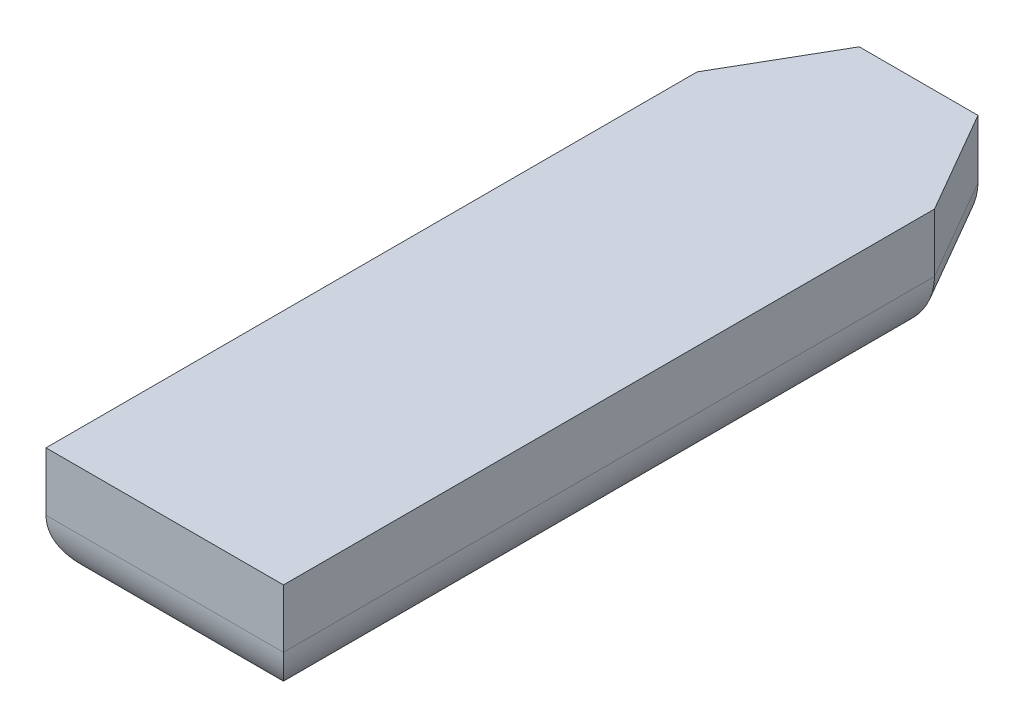
ISO-10303-21;
HEADER;
FILE_DESCRIPTION(('STEP AP214'),'2;1');
FILE_NAME('part.step','',(''),(''),'','','');
FILE_SCHEMA(('AUTOMOTIVE_DESIGN { 1 0 10303 214 1 1 1 1 }'));
ENDSEC;
DATA;
#1=APPLICATION_CONTEXT('core data for automotive mechanical design processes');
#2=APPLICATION_PROTOCOL_DEFINITION('international standard','automotive_design',2000,#1);
#3=PRODUCT_CONTEXT('',#1,'mechanical');
#4=PRODUCT('Part','Part','',(#3));
#5=PRODUCT_RELATED_PRODUCT_CATEGORY('part','',(#4));
#6=PRODUCT_DEFINITION_FORMATION('','',#4);
#7=PRODUCT_DEFINITION_CONTEXT('part definition',#1,'design');
#8=PRODUCT_DEFINITION('design','',#6,#7);
#9=PRODUCT_DEFINITION_SHAPE('','',#8);
#10=(LENGTH_UNIT() NAMED_UNIT(*) SI_UNIT(.MILLI.,.METRE.));
#11=(NAMED_UNIT(*) PLANE_ANGLE_UNIT() SI_UNIT($,.RADIAN.));
#12=(NAMED_UNIT(*) SI_UNIT($,.STERADIAN.) SOLID_ANGLE_UNIT());
#13=UNCERTAINTY_MEASURE_WITH_UNIT(LENGTH_MEASURE(1.E-05),#10,'distance_accuracy_value','');
#14=(GEOMETRIC_REPRESENTATION_CONTEXT(3) GLOBAL_UNCERTAINTY_ASSIGNED_CONTEXT((#13)) GLOBAL_UNIT_ASSIGNED_CONTEXT((#10,
#11,#12)) REPRESENTATION_CONTEXT('',''));
#15=CARTESIAN_POINT('',(0.,0.,0.));
#16=DIRECTION('',(0.,0.,1.));
#17=DIRECTION('',(1.,0.,0.));
#18=AXIS2_PLACEMENT_3D('',#15,#16,#17);
#19=CARTESIAN_POINT('',(-10.,10.,27.4198729810778));
#20=DIRECTION('',(0.,0.,-1.));
#21=DIRECTION('',(-1.,0.,0.));
#22=AXIS2_PLACEMENT_3D('',#19,#20,#21);
#23=PLANE('',#22);
#24=DIRECTION('',(0.,-1.,0.));
#25=VECTOR('',#24,1.);
#26=CARTESIAN_POINT('',(-10.,10.,27.4198729810778));
#27=LINE('',#26,#25);
#28=CARTESIAN_POINT('',(-10.,10.,27.4198729810778));
#29=VERTEX_POINT('',#28);
#30=CARTESIAN_POINT('',(-10.,5.08,27.4198729810778));
#31=VERTEX_POINT('',#30);
#32=EDGE_CURVE('E201',#29,#31,#27,.T.);
#33=ORIENTED_EDGE('',*,*,#32,.T.);
#34=DIRECTION('',(1.,0.,0.));
#35=VECTOR('',#34,1.);
#36=CARTESIAN_POINT('',(-10.,5.08,27.4198729810778));
#37=LINE('',#36,#35);
#38=CARTESIAN_POINT('',(10.,5.08,27.4198729810778));
#39=VERTEX_POINT('',#38);
#40=EDGE_CURVE('E11',#31,#39,#37,.T.);
#41=ORIENTED_EDGE('',*,*,#40,.T.);
#42=DIRECTION('',(0.,-1.,0.));
#43=VECTOR('',#42,1.);
#44=CARTESIAN_POINT('',(10.,10.,27.4198729810778));
#45=LINE('',#44,#43);
#46=CARTESIAN_POINT('',(10.,10.,27.4198729810778));
#47=VERTEX_POINT('',#46);
#48=EDGE_CURVE('E112',#47,#39,#45,.T.);
#49=ORIENTED_EDGE('',*,*,#48,.F.);
#50=DIRECTION('',(1.,0.,0.));
#51=VECTOR('',#50,1.);
#52=CARTESIAN_POINT('',(-10.,10.,27.4198729810778));
#53=LINE('',#52,#51);
#54=EDGE_CURVE('E119',#29,#47,#53,.T.);
#55=ORIENTED_EDGE('',*,*,#54,.F.);
#56=EDGE_LOOP('',(#33,#41,#49,#55));
#57=FACE_BOUND('',#56,.T.);
#58=ADVANCED_FACE('F33',(#57),#23,.F.);
#59=CARTESIAN_POINT('',(10.,10.,27.4198729810778));
#60=DIRECTION('',(-1.,0.,0.));
#61=DIRECTION('',(0.,0.,1.));
#62=AXIS2_PLACEMENT_3D('',#59,#60,#61);
#63=PLANE('',#62);
#64=ORIENTED_EDGE('',*,*,#48,.T.);
#65=DIRECTION('',(0.,0.,-1.));
#66=VECTOR('',#65,1.);
#67=CARTESIAN_POINT('',(10.,5.08,27.4198729810778));
#68=LINE('',#67,#66);
#69=CARTESIAN_POINT('',(10.,5.08,-27.4198729810779));
#70=VERTEX_POINT('',#69);
#71=EDGE_CURVE('E128',#39,#70,#68,.T.);
#72=ORIENTED_EDGE('',*,*,#71,.T.);
#73=DIRECTION('',(0.,-1.,0.));
#74=VECTOR('',#73,1.);
#75=CARTESIAN_POINT('',(10.,10.,-27.4198729810779));
#76=LINE('',#75,#74);
#77=CARTESIAN_POINT('',(10.,10.,-27.4198729810779));
#78=VERTEX_POINT('',#77);
#79=EDGE_CURVE('E115',#78,#70,#76,.T.);
#80=ORIENTED_EDGE('',*,*,#79,.F.);
#81=DIRECTION('',(0.,0.,-1.));
#82=VECTOR('',#81,1.);
#83=CARTESIAN_POINT('',(10.,10.,27.4198729810778));
#84=LINE('',#83,#82);
#85=EDGE_CURVE('E107',#47,#78,#84,.T.);
#86=ORIENTED_EDGE('',*,*,#85,.F.);
#87=EDGE_LOOP('',(#64,#72,#80,#86));
#88=FACE_BOUND('',#87,.T.);
#89=ADVANCED_FACE('F109',(#88),#63,.F.);
#90=CARTESIAN_POINT('',(10.,10.,-27.4198729810779));
#91=DIRECTION('',(-0.866025403784436,0.,0.500000000000004));
#92=DIRECTION('',(0.500000000000004,0.,0.866025403784436));
#93=AXIS2_PLACEMENT_3D('',#90,#91,#92);
#94=PLANE('',#93);
#95=ORIENTED_EDGE('',*,*,#79,.T.);
#96=DIRECTION('',(-0.500000000000004,0.,-0.866025403784436));
#97=VECTOR('',#96,1.);
#98=CARTESIAN_POINT('',(10.,5.08,-27.4198729810779));
#99=LINE('',#98,#97);
#100=CARTESIAN_POINT('',(5.,5.08,-36.0801270189222));
#101=VERTEX_POINT('',#100);
#102=EDGE_CURVE('E148',#70,#101,#99,.T.);
#103=ORIENTED_EDGE('',*,*,#102,.T.);
#104=DIRECTION('',(0.,-1.,0.));
#105=VECTOR('',#104,1.);
#106=CARTESIAN_POINT('',(5.,10.,-36.0801270189222));
#107=LINE('',#106,#105);
#108=CARTESIAN_POINT('',(5.,10.,-36.0801270189222));
#109=VERTEX_POINT('',#108);
#110=EDGE_CURVE('E132',#109,#101,#107,.T.);
#111=ORIENTED_EDGE('',*,*,#110,.F.);
#112=DIRECTION('',(-0.500000000000004,0.,-0.866025403784436));
#113=VECTOR('',#112,1.);
#114=CARTESIAN_POINT('',(10.,10.,-27.4198729810779));
#115=LINE('',#114,#113);
#116=EDGE_CURVE('E118',#78,#109,#115,.T.);
#117=ORIENTED_EDGE('',*,*,#116,.F.);
#118=EDGE_LOOP('',(#95,#103,#111,#117));
#119=FACE_BOUND('',#118,.T.);
#120=ADVANCED_FACE('F190',(#119),#94,.F.);
#121=CARTESIAN_POINT('',(-5.,10.,-36.0801270189222));
#122=DIRECTION('',(0.,0.,1.));
#123=DIRECTION('',(1.,0.,0.));
#124=AXIS2_PLACEMENT_3D('',#121,#122,#123);
#125=PLANE('',#124);
#126=ORIENTED_EDGE('',*,*,#110,.T.);
#127=DIRECTION('',(-1.,0.,0.));
#128=VECTOR('',#127,1.);
#129=CARTESIAN_POINT('',(-5.,5.08,-36.0801270189222));
#130=LINE('',#129,#128);
#131=CARTESIAN_POINT('',(-5.,5.08,-36.0801270189222));
#132=VERTEX_POINT('',#131);
#133=EDGE_CURVE('E150',#101,#132,#130,.T.);
#134=ORIENTED_EDGE('',*,*,#133,.T.);
#135=DIRECTION('',(0.,-1.,0.));
#136=VECTOR('',#135,1.);
#137=CARTESIAN_POINT('',(-5.,10.,-36.0801270189222));
#138=LINE('',#137,#136);
#139=CARTESIAN_POINT('',(-5.,10.,-36.0801270189222));
#140=VERTEX_POINT('',#139);
#141=EDGE_CURVE('E205',#140,#132,#138,.T.);
#142=ORIENTED_EDGE('',*,*,#141,.F.);
#143=DIRECTION('',(-1.,0.,0.));
#144=VECTOR('',#143,1.);
#145=CARTESIAN_POINT('',(-5.,10.,-36.0801270189222));
#146=LINE('',#145,#144);
#147=EDGE_CURVE('E194',#109,#140,#146,.T.);
#148=ORIENTED_EDGE('',*,*,#147,.F.);
#149=EDGE_LOOP('',(#126,#134,#142,#148));
#150=FACE_BOUND('',#149,.T.);
#151=ADVANCED_FACE('F207',(#150),#125,.F.);
#152=CARTESIAN_POINT('',(-5.,10.,-36.0801270189222));
#153=DIRECTION('',(0.866025403784437,0.,0.500000000000004));
#154=DIRECTION('',(0.500000000000004,0.,-0.866025403784437));
#155=AXIS2_PLACEMENT_3D('',#152,#153,#154);
#156=PLANE('',#155);
#157=ORIENTED_EDGE('',*,*,#141,.T.);
#158=DIRECTION('',(-0.500000000000004,0.,0.866025403784437));
#159=VECTOR('',#158,1.);
#160=CARTESIAN_POINT('',(-5.,5.08,-36.0801270189222));
#161=LINE('',#160,#159);
#162=CARTESIAN_POINT('',(-10.,5.08,-27.4198729810778));
#163=VERTEX_POINT('',#162);
#164=EDGE_CURVE('E57',#132,#163,#161,.T.);
#165=ORIENTED_EDGE('',*,*,#164,.T.);
#166=DIRECTION('',(0.,-1.,0.));
#167=VECTOR('',#166,1.);
#168=CARTESIAN_POINT('',(-10.,10.,-27.4198729810778));
#169=LINE('',#168,#167);
#170=CARTESIAN_POINT('',(-10.,10.,-27.4198729810778));
#171=VERTEX_POINT('',#170);
#172=EDGE_CURVE('E203',#171,#163,#169,.T.);
#173=ORIENTED_EDGE('',*,*,#172,.F.);
#174=DIRECTION('',(-0.500000000000004,0.,0.866025403784436));
#175=VECTOR('',#174,1.);
#176=CARTESIAN_POINT('',(-5.,10.,-36.0801270189222));
#177=LINE('',#176,#175);
#178=EDGE_CURVE('E196',#140,#171,#177,.T.);
#179=ORIENTED_EDGE('',*,*,#178,.F.);
#180=EDGE_LOOP('',(#157,#165,#173,#179));
#181=FACE_BOUND('',#180,.T.);
#182=ADVANCED_FACE('F232',(#181),#156,.F.);
#183=CARTESIAN_POINT('',(-10.,10.,-27.4198729810778));
#184=DIRECTION('',(1.,0.,0.));
#185=DIRECTION('',(0.,0.,-1.));
#186=AXIS2_PLACEMENT_3D('',#183,#184,#185);
#187=PLANE('',#186);
#188=ORIENTED_EDGE('',*,*,#172,.T.);
#189=DIRECTION('',(0.,0.,1.));
#190=VECTOR('',#189,1.);
#191=CARTESIAN_POINT('',(-10.,5.08,-27.4198729810778));
#192=LINE('',#191,#190);
#193=EDGE_CURVE('E42',#163,#31,#192,.T.);
#194=ORIENTED_EDGE('',*,*,#193,.T.);
#195=ORIENTED_EDGE('',*,*,#32,.F.);
#196=DIRECTION('',(0.,0.,1.));
#197=VECTOR('',#196,1.);
#198=CARTESIAN_POINT('',(-10.,10.,-27.4198729810778));
#199=LINE('',#198,#197);
#200=EDGE_CURVE('E124',#171,#29,#199,.T.);
#201=ORIENTED_EDGE('',*,*,#200,.F.);
#202=EDGE_LOOP('',(#188,#194,#195,#201));
#203=FACE_BOUND('',#202,.T.);
#204=ADVANCED_FACE('F235',(#203),#187,.F.);
#205=CARTESIAN_POINT('',(0.,10.,0.));
#206=DIRECTION('',(0.,1.,0.));
#207=DIRECTION('',(0.,0.,1.));
#208=AXIS2_PLACEMENT_3D('',#205,#206,#207);
#209=PLANE('',#208);
#210=ORIENTED_EDGE('',*,*,#54,.T.);
#211=ORIENTED_EDGE('',*,*,#85,.T.);
#212=ORIENTED_EDGE('',*,*,#116,.T.);
#213=ORIENTED_EDGE('',*,*,#147,.T.);
#214=ORIENTED_EDGE('',*,*,#178,.T.);
#215=ORIENTED_EDGE('',*,*,#200,.T.);
#216=EDGE_LOOP('',(#210,#211,#212,#213,#214,#215));
#217=FACE_BOUND('',#216,.T.);
#218=ADVANCED_FACE('F122',(#217),#209,.T.);
#219=CARTESIAN_POINT('',(0.,0.,0.));
#220=DIRECTION('',(0.,1.,0.));
#221=DIRECTION('',(0.,0.,1.));
#222=AXIS2_PLACEMENT_3D('',#219,#220,#221);
#223=PLANE('',#222);
#224=DIRECTION('',(-0.500000000000004,0.,-0.866025403784436));
#225=VECTOR('',#224,1.);
#226=CARTESIAN_POINT('',(14.9737442338531,0.,-8.64509526419176));
#227=LINE('',#226,#225);
#228=CARTESIAN_POINT('',(2.06706063251672,0.,-31.0001270189222));
#229=VERTEX_POINT('',#228);
#230=CARTESIAN_POINT('',(4.92,0.,-26.0586910835277));
#231=VERTEX_POINT('',#230);
#232=EDGE_CURVE('E143',#229,#231,#227,.F.);
#233=ORIENTED_EDGE('',*,*,#232,.T.);
#234=DIRECTION('',(0.,0.,-1.));
#235=VECTOR('',#234,1.);
#236=CARTESIAN_POINT('',(4.92,0.,0.));
#237=LINE('',#236,#235);
#238=CARTESIAN_POINT('',(4.92,0.,22.3398729810778));
#239=VERTEX_POINT('',#238);
#240=EDGE_CURVE('E145',#231,#239,#237,.F.);
#241=ORIENTED_EDGE('',*,*,#240,.T.);
#242=DIRECTION('',(1.,0.,0.));
#243=VECTOR('',#242,1.);
#244=CARTESIAN_POINT('',(0.,0.,22.3398729810778));
#245=LINE('',#244,#243);
#246=CARTESIAN_POINT('',(-4.92,0.,22.3398729810778));
#247=VERTEX_POINT('',#246);
#248=EDGE_CURVE('E130',#239,#247,#245,.F.);
#249=ORIENTED_EDGE('',*,*,#248,.T.);
#250=DIRECTION('',(0.,0.,1.));
#251=VECTOR('',#250,1.);
#252=CARTESIAN_POINT('',(-4.92,0.,0.));
#253=LINE('',#252,#251);
#254=CARTESIAN_POINT('',(-4.92,0.,-26.0586910835277));
#255=VERTEX_POINT('',#254);
#256=EDGE_CURVE('E137',#247,#255,#253,.F.);
#257=ORIENTED_EDGE('',*,*,#256,.T.);
#258=DIRECTION('',(-0.500000000000004,0.,0.866025403784437));
#259=VECTOR('',#258,1.);
#260=CARTESIAN_POINT('',(-14.9737442338531,0.,-8.64509526419176));
#261=LINE('',#260,#259);
#262=CARTESIAN_POINT('',(-2.06706063251671,0.,-31.0001270189222));
#263=VERTEX_POINT('',#262);
#264=EDGE_CURVE('E139',#255,#263,#261,.F.);
#265=ORIENTED_EDGE('',*,*,#264,.T.);
#266=DIRECTION('',(-1.,0.,0.));
#267=VECTOR('',#266,1.);
#268=CARTESIAN_POINT('',(0.,0.,-31.0001270189222));
#269=LINE('',#268,#267);
#270=EDGE_CURVE('E141',#263,#229,#269,.F.);
#271=ORIENTED_EDGE('',*,*,#270,.T.);
#272=EDGE_LOOP('',(#233,#241,#249,#257,#265,#271));
#273=FACE_BOUND('',#272,.T.);
#274=ADVANCED_FACE('F178',(#273),#223,.F.);
#275=CARTESIAN_POINT('',(-0.600590948775061,5.08,-33.5401270189221));
#276=DIRECTION('',(-0.500000000000004,0.,0.866025403784437));
#277=DIRECTION('',(0.866025403784437,0.,0.500000000000004));
#278=AXIS2_PLACEMENT_3D('',#275,#276,#277);
#279=CYLINDRICAL_SURFACE('',#278,5.08);
#280=CARTESIAN_POINT('',(-2.06706063251671,5.08,-31.0001270189222));
#281=DIRECTION('',(-0.86602540378444,0.,0.499999999999998));
#282=DIRECTION('',(0.499999999999998,0.,0.86602540378444));
#283=AXIS2_PLACEMENT_3D('',#280,#281,#282);
#284=ELLIPSE('',#283,5.86587873496659,5.08);
#285=EDGE_CURVE('E163',#263,#132,#284,.F.);
#286=ORIENTED_EDGE('',*,*,#285,.F.);
#287=ORIENTED_EDGE('',*,*,#264,.F.);
#288=CARTESIAN_POINT('',(-4.92,5.08,-26.0586910835277));
#289=DIRECTION('',(-0.258819045102523,0.,0.965925826289068));
#290=DIRECTION('',(0.965925826289068,0.,0.258819045102523));
#291=AXIS2_PLACEMENT_3D('',#288,#289,#290);
#292=ELLIPSE('',#291,5.25920299648322,5.08);
#293=EDGE_CURVE('E37',#163,#255,#292,.T.);
#294=ORIENTED_EDGE('',*,*,#293,.F.);
#295=ORIENTED_EDGE('',*,*,#164,.F.);
#296=EDGE_LOOP('',(#286,#287,#294,#295));
#297=FACE_BOUND('',#296,.T.);
#298=ADVANCED_FACE('F35',(#297),#279,.T.);
#299=CARTESIAN_POINT('',(-4.92,5.08,-27.4198729810778));
#300=DIRECTION('',(0.,0.,1.));
#301=DIRECTION('',(1.,0.,0.));
#302=AXIS2_PLACEMENT_3D('',#299,#300,#301);
#303=CYLINDRICAL_SURFACE('',#302,5.08);
#304=ORIENTED_EDGE('',*,*,#293,.T.);
#305=ORIENTED_EDGE('',*,*,#256,.F.);
#306=CARTESIAN_POINT('',(-4.92,5.08,22.3398729810778));
#307=DIRECTION('',(0.707106781186547,0.,0.707106781186547));
#308=DIRECTION('',(0.707106781186547,0.,-0.707106781186547));
#309=AXIS2_PLACEMENT_3D('',#306,#307,#308);
#310=ELLIPSE('',#309,7.18420489685532,5.08);
#311=EDGE_CURVE('E161',#31,#247,#310,.T.);
#312=ORIENTED_EDGE('',*,*,#311,.F.);
#313=ORIENTED_EDGE('',*,*,#193,.F.);
#314=EDGE_LOOP('',(#304,#305,#312,#313));
#315=FACE_BOUND('',#314,.T.);
#316=ADVANCED_FACE('F173',(#315),#303,.T.);
#317=CARTESIAN_POINT('',(-5.,5.08,-31.0001270189222));
#318=DIRECTION('',(-1.,0.,0.));
#319=DIRECTION('',(0.,0.,1.));
#320=AXIS2_PLACEMENT_3D('',#317,#318,#319);
#321=CYLINDRICAL_SURFACE('',#320,5.08);
#322=ORIENTED_EDGE('',*,*,#285,.T.);
#323=ORIENTED_EDGE('',*,*,#133,.F.);
#324=CARTESIAN_POINT('',(2.06706063251672,5.08,-31.0001270189222));
#325=DIRECTION('',(-0.86602540378444,0.,-0.499999999999998));
#326=DIRECTION('',(-0.499999999999998,0.,0.86602540378444));
#327=AXIS2_PLACEMENT_3D('',#324,#325,#326);
#328=ELLIPSE('',#327,5.86587873496659,5.08);
#329=EDGE_CURVE('E158',#229,#101,#328,.F.);
#330=ORIENTED_EDGE('',*,*,#329,.F.);
#331=ORIENTED_EDGE('',*,*,#270,.F.);
#332=EDGE_LOOP('',(#322,#323,#330,#331));
#333=FACE_BOUND('',#332,.T.);
#334=ADVANCED_FACE('F209',(#333),#321,.T.);
#335=CARTESIAN_POINT('',(-10.,5.08,22.3398729810778));
#336=DIRECTION('',(1.,0.,0.));
#337=DIRECTION('',(0.,0.,-1.));
#338=AXIS2_PLACEMENT_3D('',#335,#336,#337);
#339=CYLINDRICAL_SURFACE('',#338,5.08);
#340=ORIENTED_EDGE('',*,*,#311,.T.);
#341=ORIENTED_EDGE('',*,*,#248,.F.);
#342=CARTESIAN_POINT('',(4.92,5.08,22.3398729810778));
#343=DIRECTION('',(0.707106781186547,0.,-0.707106781186547));
#344=DIRECTION('',(0.707106781186547,0.,0.707106781186547));
#345=AXIS2_PLACEMENT_3D('',#342,#343,#344);
#346=ELLIPSE('',#345,7.18420489685532,5.08);
#347=EDGE_CURVE('E156',#39,#239,#346,.T.);
#348=ORIENTED_EDGE('',*,*,#347,.F.);
#349=ORIENTED_EDGE('',*,*,#40,.F.);
#350=EDGE_LOOP('',(#340,#341,#348,#349));
#351=FACE_BOUND('',#350,.T.);
#352=ADVANCED_FACE('F183',(#351),#339,.T.);
#353=CARTESIAN_POINT('',(5.60059094877506,5.08,-24.8798729810778));
#354=DIRECTION('',(-0.500000000000004,0.,-0.866025403784436));
#355=DIRECTION('',(-0.866025403784436,0.,0.500000000000004));
#356=AXIS2_PLACEMENT_3D('',#353,#354,#355);
#357=CYLINDRICAL_SURFACE('',#356,5.08);
#358=ORIENTED_EDGE('',*,*,#329,.T.);
#359=ORIENTED_EDGE('',*,*,#102,.F.);
#360=CARTESIAN_POINT('',(4.92,5.08,-26.0586910835277));
#361=DIRECTION('',(-0.258819045102523,0.,-0.965925826289068));
#362=DIRECTION('',(-0.965925826289068,0.,0.258819045102523));
#363=AXIS2_PLACEMENT_3D('',#360,#361,#362);
#364=ELLIPSE('',#363,5.25920299648322,5.08);
#365=EDGE_CURVE('E154',#231,#70,#364,.F.);
#366=ORIENTED_EDGE('',*,*,#365,.F.);
#367=ORIENTED_EDGE('',*,*,#232,.F.);
#368=EDGE_LOOP('',(#358,#359,#366,#367));
#369=FACE_BOUND('',#368,.T.);
#370=ADVANCED_FACE('F212',(#369),#357,.T.);
#371=CARTESIAN_POINT('',(4.92,5.08,27.4198729810778));
#372=DIRECTION('',(0.,0.,-1.));
#373=DIRECTION('',(-1.,0.,0.));
#374=AXIS2_PLACEMENT_3D('',#371,#372,#373);
#375=CYLINDRICAL_SURFACE('',#374,5.08);
#376=ORIENTED_EDGE('',*,*,#347,.T.);
#377=ORIENTED_EDGE('',*,*,#240,.F.);
#378=ORIENTED_EDGE('',*,*,#365,.T.);
#379=ORIENTED_EDGE('',*,*,#71,.F.);
#380=EDGE_LOOP('',(#376,#377,#378,#379));
#381=FACE_BOUND('',#380,.T.);
#382=ADVANCED_FACE('F186',(#381),#375,.T.);
#383=CLOSED_SHELL('',(#58,#89,#120,#151,#182,#204,#218,#274,#298,#316,#334,#352,#370,#382));
#384=MANIFOLD_SOLID_BREP('B2',#383);
#385=ADVANCED_BREP_SHAPE_REPRESENTATION('',(#18,#384),#14);
#386=SHAPE_DEFINITION_REPRESENTATION(#9,#385);
ENDSEC;
END-ISO-10303-21;
